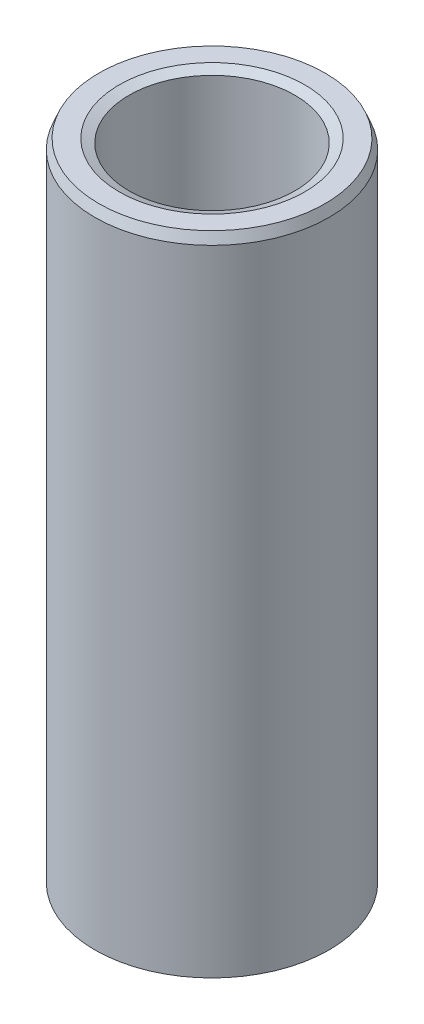
ISO-10303-21;
HEADER;
FILE_DESCRIPTION(('STEP AP214'),'2;1');
FILE_NAME('part.step','',(''),(''),'','','');
FILE_SCHEMA(('AUTOMOTIVE_DESIGN { 1 0 10303 214 1 1 1 1 }'));
ENDSEC;
DATA;
#1=APPLICATION_CONTEXT('core data for automotive mechanical design processes');
#2=APPLICATION_PROTOCOL_DEFINITION('international standard','automotive_design',2000,#1);
#3=PRODUCT_CONTEXT('',#1,'mechanical');
#4=PRODUCT('Part','Part','',(#3));
#5=PRODUCT_RELATED_PRODUCT_CATEGORY('part','',(#4));
#6=PRODUCT_DEFINITION_FORMATION('','',#4);
#7=PRODUCT_DEFINITION_CONTEXT('part definition',#1,'design');
#8=PRODUCT_DEFINITION('design','',#6,#7);
#9=PRODUCT_DEFINITION_SHAPE('','',#8);
#10=(LENGTH_UNIT() NAMED_UNIT(*) SI_UNIT(.MILLI.,.METRE.));
#11=(NAMED_UNIT(*) PLANE_ANGLE_UNIT() SI_UNIT($,.RADIAN.));
#12=(NAMED_UNIT(*) SI_UNIT($,.STERADIAN.) SOLID_ANGLE_UNIT());
#13=UNCERTAINTY_MEASURE_WITH_UNIT(LENGTH_MEASURE(1.E-05),#10,'distance_accuracy_value','');
#14=(GEOMETRIC_REPRESENTATION_CONTEXT(3) GLOBAL_UNCERTAINTY_ASSIGNED_CONTEXT((#13)) GLOBAL_UNIT_ASSIGNED_CONTEXT((#10,
#11,#12)) REPRESENTATION_CONTEXT('',''));
#15=CARTESIAN_POINT('',(0.,0.,0.));
#16=DIRECTION('',(0.,0.,1.));
#17=DIRECTION('',(1.,0.,0.));
#18=AXIS2_PLACEMENT_3D('',#15,#16,#17);
#19=CARTESIAN_POINT('',(0.,179.811402842181,0.));
#20=DIRECTION('',(0.,-1.,0.));
#21=DIRECTION('',(0.,0.,-1.));
#22=AXIS2_PLACEMENT_3D('',#19,#20,#21);
#23=CYLINDRICAL_SURFACE('',#22,32.5);
#24=CARTESIAN_POINT('',(0.,1.12662653617857,0.));
#25=DIRECTION('',(0.,1.,0.));
#26=DIRECTION('',(0.,0.,1.));
#27=AXIS2_PLACEMENT_3D('',#24,#25,#26);
#28=CIRCLE('',#27,32.5);
#29=CARTESIAN_POINT('',(0.,1.12662653617857,32.5));
#30=VERTEX_POINT('',#29);
#31=EDGE_CURVE('E10',#30,#30,#28,.T.);
#32=ORIENTED_EDGE('',*,*,#31,.T.);
#33=EDGE_LOOP('',(#32));
#34=FACE_BOUND('',#33,.T.);
#35=CARTESIAN_POINT('',(0.,177.078979989264,0.));
#36=DIRECTION('',(0.,1.,0.));
#37=DIRECTION('',(0.,0.,1.));
#38=AXIS2_PLACEMENT_3D('',#35,#36,#37);
#39=CIRCLE('',#38,32.5);
#40=CARTESIAN_POINT('',(0.,177.078979989264,32.5));
#41=VERTEX_POINT('',#40);
#42=EDGE_CURVE('E50',#41,#41,#39,.F.);
#43=ORIENTED_EDGE('',*,*,#42,.T.);
#44=EDGE_LOOP('',(#43));
#45=FACE_BOUND('',#44,.T.);
#46=ADVANCED_FACE('F39',(#34,#45),#23,.T.);
#47=CARTESIAN_POINT('',(0.,179.811402842181,0.));
#48=DIRECTION('',(0.,1.,0.));
#49=DIRECTION('',(0.,0.,1.));
#50=AXIS2_PLACEMENT_3D('',#47,#48,#49);
#51=PLANE('',#50);
#52=CARTESIAN_POINT('',(0.,179.811402842181,0.));
#53=DIRECTION('',(0.,1.,0.));
#54=DIRECTION('',(0.,0.,1.));
#55=AXIS2_PLACEMENT_3D('',#52,#53,#54);
#56=CIRCLE('',#55,25.7340684445525);
#57=CARTESIAN_POINT('',(0.,179.811402842181,25.7340684445525));
#58=VERTEX_POINT('',#57);
#59=EDGE_CURVE('E58',#58,#58,#56,.F.);
#60=ORIENTED_EDGE('',*,*,#59,.T.);
#61=EDGE_LOOP('',(#60));
#62=FACE_BOUND('',#61,.T.);
#63=CARTESIAN_POINT('',(0.,179.811402842181,0.));
#64=DIRECTION('',(0.,1.,0.));
#65=DIRECTION('',(0.,0.,1.));
#66=AXIS2_PLACEMENT_3D('',#63,#64,#65);
#67=CIRCLE('',#66,31.3733734638214);
#68=CARTESIAN_POINT('',(0.,179.811402842181,31.3733734638214));
#69=VERTEX_POINT('',#68);
#70=EDGE_CURVE('E61',#69,#69,#67,.T.);
#71=ORIENTED_EDGE('',*,*,#70,.T.);
#72=EDGE_LOOP('',(#71));
#73=FACE_BOUND('',#72,.T.);
#74=ADVANCED_FACE('F88',(#62,#73),#51,.T.);
#75=CARTESIAN_POINT('',(0.,0.,0.));
#76=DIRECTION('',(0.,1.,0.));
#77=DIRECTION('',(0.,0.,1.));
#78=AXIS2_PLACEMENT_3D('',#75,#76,#77);
#79=PLANE('',#78);
#80=CARTESIAN_POINT('',(0.,0.,0.));
#81=DIRECTION('',(0.,1.,0.));
#82=DIRECTION('',(0.,0.,1.));
#83=AXIS2_PLACEMENT_3D('',#80,#81,#82);
#84=CIRCLE('',#83,24.1282721278141);
#85=CARTESIAN_POINT('',(0.,0.,24.1282721278141));
#86=VERTEX_POINT('',#85);
#87=EDGE_CURVE('E51',#86,#86,#84,.T.);
#88=ORIENTED_EDGE('',*,*,#87,.T.);
#89=EDGE_LOOP('',(#88));
#90=FACE_BOUND('',#89,.T.);
#91=CARTESIAN_POINT('',(0.,0.,0.));
#92=DIRECTION('',(0.,1.,0.));
#93=DIRECTION('',(0.,0.,1.));
#94=AXIS2_PLACEMENT_3D('',#91,#92,#93);
#95=CIRCLE('',#94,29.7675771470831);
#96=CARTESIAN_POINT('',(0.,0.,29.7675771470831));
#97=VERTEX_POINT('',#96);
#98=EDGE_CURVE('E54',#97,#97,#95,.F.);
#99=ORIENTED_EDGE('',*,*,#98,.T.);
#100=EDGE_LOOP('',(#99));
#101=FACE_BOUND('',#100,.T.);
#102=ADVANCED_FACE('F83',(#90,#101),#79,.F.);
#103=CARTESIAN_POINT('',(0.,179.811402842181,0.));
#104=DIRECTION('',(0.,-1.,0.));
#105=DIRECTION('',(0.,0.,-1.));
#106=AXIS2_PLACEMENT_3D('',#103,#104,#105);
#107=CYLINDRICAL_SURFACE('',#106,23.0016455916356);
#108=CARTESIAN_POINT('',(0.,178.684776306002,0.));
#109=DIRECTION('',(0.,1.,0.));
#110=DIRECTION('',(0.,0.,1.));
#111=AXIS2_PLACEMENT_3D('',#108,#109,#110);
#112=CIRCLE('',#111,23.0016455916356);
#113=CARTESIAN_POINT('',(0.,178.684776306002,23.0016455916356));
#114=VERTEX_POINT('',#113);
#115=EDGE_CURVE('E67',#114,#114,#112,.T.);
#116=ORIENTED_EDGE('',*,*,#115,.T.);
#117=EDGE_LOOP('',(#116));
#118=FACE_BOUND('',#117,.T.);
#119=CARTESIAN_POINT('',(0.,2.73242285291692,0.));
#120=DIRECTION('',(0.,1.,0.));
#121=DIRECTION('',(0.,0.,1.));
#122=AXIS2_PLACEMENT_3D('',#119,#120,#121);
#123=CIRCLE('',#122,23.0016455916356);
#124=CARTESIAN_POINT('',(0.,2.73242285291692,23.0016455916356));
#125=VERTEX_POINT('',#124);
#126=EDGE_CURVE('E69',#125,#125,#123,.F.);
#127=ORIENTED_EDGE('',*,*,#126,.T.);
#128=EDGE_LOOP('',(#127));
#129=FACE_BOUND('',#128,.T.);
#130=ADVANCED_FACE('F71',(#118,#129),#107,.F.);
#131=CARTESIAN_POINT('',(0.,178.684776306002,0.));
#132=DIRECTION('',(0.,1.,0.));
#133=DIRECTION('',(0.,0.,1.));
#134=AXIS2_PLACEMENT_3D('',#131,#132,#133);
#135=CONICAL_SURFACE('',#134,23.0016455916356,1.17971647688428);
#136=ORIENTED_EDGE('',*,*,#59,.F.);
#137=EDGE_LOOP('',(#136));
#138=FACE_BOUND('',#137,.T.);
#139=ORIENTED_EDGE('',*,*,#115,.F.);
#140=EDGE_LOOP('',(#139));
#141=FACE_BOUND('',#140,.T.);
#142=ADVANCED_FACE('F77',(#138,#141),#135,.F.);
#143=CARTESIAN_POINT('',(0.,0.,0.));
#144=DIRECTION('',(0.,-1.,0.));
#145=DIRECTION('',(0.,0.,-1.));
#146=AXIS2_PLACEMENT_3D('',#143,#144,#145);
#147=CONICAL_SURFACE('',#146,24.1282721278141,0.391079849910625);
#148=ORIENTED_EDGE('',*,*,#126,.F.);
#149=EDGE_LOOP('',(#148));
#150=FACE_BOUND('',#149,.T.);
#151=ORIENTED_EDGE('',*,*,#87,.F.);
#152=EDGE_LOOP('',(#151));
#153=FACE_BOUND('',#152,.T.);
#154=ADVANCED_FACE('F73',(#150,#153),#147,.F.);
#155=CARTESIAN_POINT('',(0.,1.12662653617857,0.));
#156=DIRECTION('',(0.,1.,0.));
#157=DIRECTION('',(0.,0.,1.));
#158=AXIS2_PLACEMENT_3D('',#155,#156,#157);
#159=CONICAL_SURFACE('',#158,32.5,1.17971647688427);
#160=ORIENTED_EDGE('',*,*,#98,.F.);
#161=EDGE_LOOP('',(#160));
#162=FACE_BOUND('',#161,.T.);
#163=ORIENTED_EDGE('',*,*,#31,.F.);
#164=EDGE_LOOP('',(#163));
#165=FACE_BOUND('',#164,.T.);
#166=ADVANCED_FACE('F76',(#162,#165),#159,.T.);
#167=CARTESIAN_POINT('',(0.,179.811402842181,0.));
#168=DIRECTION('',(0.,-1.,0.));
#169=DIRECTION('',(0.,0.,-1.));
#170=AXIS2_PLACEMENT_3D('',#167,#168,#169);
#171=CONICAL_SURFACE('',#170,31.3733734638214,0.39107984991062);
#172=ORIENTED_EDGE('',*,*,#42,.F.);
#173=EDGE_LOOP('',(#172));
#174=FACE_BOUND('',#173,.T.);
#175=ORIENTED_EDGE('',*,*,#70,.F.);
#176=EDGE_LOOP('',(#175));
#177=FACE_BOUND('',#176,.T.);
#178=ADVANCED_FACE('F45',(#174,#177),#171,.T.);
#179=CLOSED_SHELL('',(#46,#74,#102,#130,#142,#154,#166,#178));
#180=MANIFOLD_SOLID_BREP('B2',#179);
#181=ADVANCED_BREP_SHAPE_REPRESENTATION('',(#18,#180),#14);
#182=SHAPE_DEFINITION_REPRESENTATION(#9,#181);
ENDSEC;
END-ISO-10303-21;
